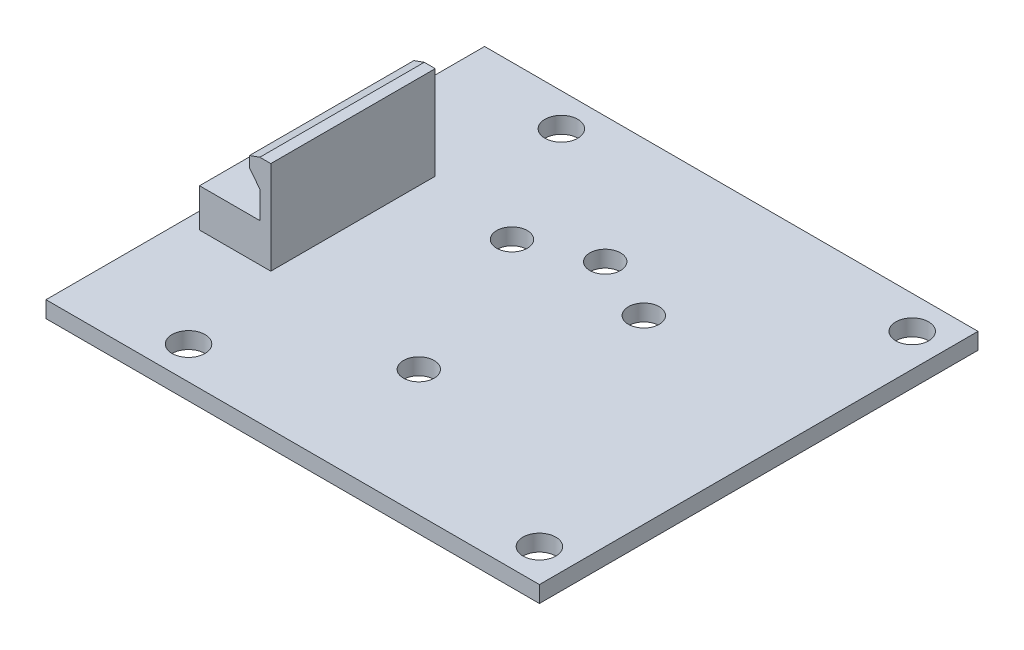
ISO-10303-21;
HEADER;
FILE_DESCRIPTION(('STEP AP214'),'2;1');
FILE_NAME('part.step','',(''),(''),'','','');
FILE_SCHEMA(('AUTOMOTIVE_DESIGN { 1 0 10303 214 1 1 1 1 }'));
ENDSEC;
DATA;
#1=APPLICATION_CONTEXT('core data for automotive mechanical design processes');
#2=APPLICATION_PROTOCOL_DEFINITION('international standard','automotive_design',2000,#1);
#3=PRODUCT_CONTEXT('',#1,'mechanical');
#4=PRODUCT('Part','Part','',(#3));
#5=PRODUCT_RELATED_PRODUCT_CATEGORY('part','',(#4));
#6=PRODUCT_DEFINITION_FORMATION('','',#4);
#7=PRODUCT_DEFINITION_CONTEXT('part definition',#1,'design');
#8=PRODUCT_DEFINITION('design','',#6,#7);
#9=PRODUCT_DEFINITION_SHAPE('','',#8);
#10=(LENGTH_UNIT() NAMED_UNIT(*) SI_UNIT(.MILLI.,.METRE.));
#11=(NAMED_UNIT(*) PLANE_ANGLE_UNIT() SI_UNIT($,.RADIAN.));
#12=(NAMED_UNIT(*) SI_UNIT($,.STERADIAN.) SOLID_ANGLE_UNIT());
#13=UNCERTAINTY_MEASURE_WITH_UNIT(LENGTH_MEASURE(1.E-05),#10,'distance_accuracy_value','');
#14=(GEOMETRIC_REPRESENTATION_CONTEXT(3) GLOBAL_UNCERTAINTY_ASSIGNED_CONTEXT((#13)) GLOBAL_UNIT_ASSIGNED_CONTEXT((#10,
#11,#12)) REPRESENTATION_CONTEXT('',''));
#15=CARTESIAN_POINT('',(0.,0.,0.));
#16=DIRECTION('',(0.,0.,1.));
#17=DIRECTION('',(1.,0.,0.));
#18=AXIS2_PLACEMENT_3D('',#15,#16,#17);
#19=CARTESIAN_POINT('',(0.,3.5,0.));
#20=DIRECTION('',(0.,-1.,0.));
#21=DIRECTION('',(0.,0.,-1.));
#22=AXIS2_PLACEMENT_3D('',#19,#20,#21);
#23=PLANE('',#22);
#24=DIRECTION('',(0.,0.,1.));
#25=VECTOR('',#24,1.);
#26=CARTESIAN_POINT('',(-15.5,3.5,7.50000000000001));
#27=LINE('',#26,#25);
#28=CARTESIAN_POINT('',(-15.5,3.5,-7.49999999999999));
#29=VERTEX_POINT('',#28);
#30=CARTESIAN_POINT('',(-15.5,3.5,7.50000000000001));
#31=VERTEX_POINT('',#30);
#32=EDGE_CURVE('E156',#29,#31,#27,.T.);
#33=ORIENTED_EDGE('',*,*,#32,.F.);
#34=DIRECTION('',(-1.,0.,0.));
#35=VECTOR('',#34,1.);
#36=CARTESIAN_POINT('',(-21.,3.5,-7.49999999999999));
#37=LINE('',#36,#35);
#38=CARTESIAN_POINT('',(-21.,3.5,-7.49999999999999));
#39=VERTEX_POINT('',#38);
#40=EDGE_CURVE('E170',#29,#39,#37,.T.);
#41=ORIENTED_EDGE('',*,*,#40,.T.);
#42=DIRECTION('',(0.,0.,1.));
#43=VECTOR('',#42,1.);
#44=CARTESIAN_POINT('',(-21.,3.5,7.50000000000001));
#45=LINE('',#44,#43);
#46=CARTESIAN_POINT('',(-21.,3.5,7.50000000000001));
#47=VERTEX_POINT('',#46);
#48=EDGE_CURVE('E164',#39,#47,#45,.T.);
#49=ORIENTED_EDGE('',*,*,#48,.T.);
#50=DIRECTION('',(1.,0.,0.));
#51=VECTOR('',#50,1.);
#52=CARTESIAN_POINT('',(-21.,3.5,7.50000000000001));
#53=LINE('',#52,#51);
#54=EDGE_CURVE('E255',#47,#31,#53,.T.);
#55=ORIENTED_EDGE('',*,*,#54,.T.);
#56=EDGE_LOOP('',(#33,#41,#49,#55));
#57=FACE_BOUND('',#56,.T.);
#58=ADVANCED_FACE('F33',(#57),#23,.F.);
#59=CARTESIAN_POINT('',(0.,0.,0.));
#60=DIRECTION('',(0.,1.,0.));
#61=DIRECTION('',(0.,0.,1.));
#62=AXIS2_PLACEMENT_3D('',#59,#60,#61);
#63=PLANE('',#62);
#64=CARTESIAN_POINT('',(19.5,0.,17.));
#65=DIRECTION('',(0.,1.,0.));
#66=DIRECTION('',(0.,0.,1.));
#67=AXIS2_PLACEMENT_3D('',#64,#65,#66);
#68=CIRCLE('',#67,1.5);
#69=CARTESIAN_POINT('',(19.5,0.,18.5));
#70=VERTEX_POINT('',#69);
#71=EDGE_CURVE('E524',#70,#70,#68,.T.);
#72=ORIENTED_EDGE('',*,*,#71,.F.);
#73=EDGE_LOOP('',(#72));
#74=FACE_BOUND('',#73,.T.);
#75=CARTESIAN_POINT('',(19.5,0.,-17.));
#76=DIRECTION('',(0.,1.,0.));
#77=DIRECTION('',(0.,0.,1.));
#78=AXIS2_PLACEMENT_3D('',#75,#76,#77);
#79=CIRCLE('',#78,1.5);
#80=CARTESIAN_POINT('',(19.5,0.,-15.5));
#81=VERTEX_POINT('',#80);
#82=EDGE_CURVE('E526',#81,#81,#79,.T.);
#83=ORIENTED_EDGE('',*,*,#82,.F.);
#84=EDGE_LOOP('',(#83));
#85=FACE_BOUND('',#84,.T.);
#86=CARTESIAN_POINT('',(-12.5,0.,17.));
#87=DIRECTION('',(0.,1.,0.));
#88=DIRECTION('',(0.,0.,1.));
#89=AXIS2_PLACEMENT_3D('',#86,#87,#88);
#90=CIRCLE('',#89,1.5);
#91=CARTESIAN_POINT('',(-12.5,0.,18.5));
#92=VERTEX_POINT('',#91);
#93=EDGE_CURVE('E532',#92,#92,#90,.T.);
#94=ORIENTED_EDGE('',*,*,#93,.F.);
#95=EDGE_LOOP('',(#94));
#96=FACE_BOUND('',#95,.T.);
#97=CARTESIAN_POINT('',(-12.5,0.,-17.));
#98=DIRECTION('',(0.,1.,0.));
#99=DIRECTION('',(0.,0.,1.));
#100=AXIS2_PLACEMENT_3D('',#97,#98,#99);
#101=CIRCLE('',#100,1.5);
#102=CARTESIAN_POINT('',(-12.5,0.,-15.5));
#103=VERTEX_POINT('',#102);
#104=EDGE_CURVE('E538',#103,#103,#101,.T.);
#105=ORIENTED_EDGE('',*,*,#104,.F.);
#106=EDGE_LOOP('',(#105));
#107=FACE_BOUND('',#106,.T.);
#108=DIRECTION('',(0.,0.,-1.));
#109=VECTOR('',#108,1.);
#110=CARTESIAN_POINT('',(22.5,0.,-20.));
#111=LINE('',#110,#109);
#112=CARTESIAN_POINT('',(22.5,0.,20.));
#113=VERTEX_POINT('',#112);
#114=CARTESIAN_POINT('',(22.5,0.,-20.));
#115=VERTEX_POINT('',#114);
#116=EDGE_CURVE('E225',#113,#115,#111,.T.);
#117=ORIENTED_EDGE('',*,*,#116,.T.);
#118=DIRECTION('',(-1.,0.,0.));
#119=VECTOR('',#118,1.);
#120=CARTESIAN_POINT('',(-22.5,0.,-20.));
#121=LINE('',#120,#119);
#122=CARTESIAN_POINT('',(-22.5,0.,-20.));
#123=VERTEX_POINT('',#122);
#124=EDGE_CURVE('E244',#115,#123,#121,.T.);
#125=ORIENTED_EDGE('',*,*,#124,.T.);
#126=DIRECTION('',(0.,0.,1.));
#127=VECTOR('',#126,1.);
#128=CARTESIAN_POINT('',(-22.5,0.,-20.));
#129=LINE('',#128,#127);
#130=CARTESIAN_POINT('',(-22.5,0.,20.));
#131=VERTEX_POINT('',#130);
#132=EDGE_CURVE('E247',#123,#131,#129,.T.);
#133=ORIENTED_EDGE('',*,*,#132,.T.);
#134=DIRECTION('',(1.,0.,0.));
#135=VECTOR('',#134,1.);
#136=CARTESIAN_POINT('',(-22.5,0.,20.));
#137=LINE('',#136,#135);
#138=EDGE_CURVE('E232',#131,#113,#137,.T.);
#139=ORIENTED_EDGE('',*,*,#138,.T.);
#140=EDGE_LOOP('',(#117,#125,#133,#139));
#141=FACE_BOUND('',#140,.T.);
#142=CARTESIAN_POINT('',(0.,0.,-8.5));
#143=DIRECTION('',(0.,1.,0.));
#144=DIRECTION('',(0.,0.,1.));
#145=AXIS2_PLACEMENT_3D('',#142,#143,#144);
#146=CIRCLE('',#145,1.4);
#147=CARTESIAN_POINT('',(0.,0.,-7.1));
#148=VERTEX_POINT('',#147);
#149=EDGE_CURVE('E219',#148,#148,#146,.T.);
#150=ORIENTED_EDGE('',*,*,#149,.F.);
#151=EDGE_LOOP('',(#150));
#152=FACE_BOUND('',#151,.T.);
#153=CARTESIAN_POINT('',(6.01040764008599,0.,-6.01040764008532));
#154=DIRECTION('',(0.,1.,0.));
#155=DIRECTION('',(0.,0.,1.));
#156=AXIS2_PLACEMENT_3D('',#153,#154,#155);
#157=CIRCLE('',#156,1.39999999999956);
#158=CARTESIAN_POINT('',(6.01040764008599,0.,-4.61040764008576));
#159=VERTEX_POINT('',#158);
#160=EDGE_CURVE('E213',#159,#159,#157,.T.);
#161=ORIENTED_EDGE('',*,*,#160,.F.);
#162=EDGE_LOOP('',(#161));
#163=FACE_BOUND('',#162,.T.);
#164=CARTESIAN_POINT('',(-1.89011295036722E-12,0.,8.5));
#165=DIRECTION('',(0.,1.,0.));
#166=DIRECTION('',(0.,0.,1.));
#167=AXIS2_PLACEMENT_3D('',#164,#165,#166);
#168=CIRCLE('',#167,1.39999999999825);
#169=CARTESIAN_POINT('',(-1.89011295036722E-12,0.,9.89999999999825));
#170=VERTEX_POINT('',#169);
#171=EDGE_CURVE('E207',#170,#170,#168,.T.);
#172=ORIENTED_EDGE('',*,*,#171,.F.);
#173=EDGE_LOOP('',(#172));
#174=FACE_BOUND('',#173,.T.);
#175=CARTESIAN_POINT('',(-6.01040764008332,0.,-6.01040764008799));
#176=DIRECTION('',(0.,1.,0.));
#177=DIRECTION('',(0.,0.,1.));
#178=AXIS2_PLACEMENT_3D('',#175,#176,#177);
#179=CIRCLE('',#178,1.39999999999694);
#180=CARTESIAN_POINT('',(-6.01040764008332,0.,-4.61040764009105));
#181=VERTEX_POINT('',#180);
#182=EDGE_CURVE('E203',#181,#181,#179,.T.);
#183=ORIENTED_EDGE('',*,*,#182,.F.);
#184=EDGE_LOOP('',(#183));
#185=FACE_BOUND('',#184,.T.);
#186=DIRECTION('',(1.,0.,0.));
#187=VECTOR('',#186,1.);
#188=CARTESIAN_POINT('',(-21.,0.,7.50000000000001));
#189=LINE('',#188,#187);
#190=CARTESIAN_POINT('',(-21.,0.,7.50000000000001));
#191=VERTEX_POINT('',#190);
#192=CARTESIAN_POINT('',(-14.5,0.,7.50000000000001));
#193=VERTEX_POINT('',#192);
#194=EDGE_CURVE('E181',#191,#193,#189,.T.);
#195=ORIENTED_EDGE('',*,*,#194,.F.);
#196=DIRECTION('',(0.,0.,1.));
#197=VECTOR('',#196,1.);
#198=CARTESIAN_POINT('',(-21.,0.,7.50000000000001));
#199=LINE('',#198,#197);
#200=CARTESIAN_POINT('',(-21.,0.,-7.49999999999999));
#201=VERTEX_POINT('',#200);
#202=EDGE_CURVE('E179',#201,#191,#199,.T.);
#203=ORIENTED_EDGE('',*,*,#202,.F.);
#204=DIRECTION('',(-1.,0.,0.));
#205=VECTOR('',#204,1.);
#206=CARTESIAN_POINT('',(-21.,0.,-7.49999999999999));
#207=LINE('',#206,#205);
#208=CARTESIAN_POINT('',(-14.5,0.,-7.49999999999999));
#209=VERTEX_POINT('',#208);
#210=EDGE_CURVE('E193',#209,#201,#207,.T.);
#211=ORIENTED_EDGE('',*,*,#210,.F.);
#212=DIRECTION('',(0.,0.,-1.));
#213=VECTOR('',#212,1.);
#214=CARTESIAN_POINT('',(-14.5,0.,7.50000000000001));
#215=LINE('',#214,#213);
#216=EDGE_CURVE('E188',#193,#209,#215,.T.);
#217=ORIENTED_EDGE('',*,*,#216,.F.);
#218=EDGE_LOOP('',(#195,#203,#211,#217));
#219=FACE_BOUND('',#218,.T.);
#220=ADVANCED_FACE('F269',(#74,#85,#96,#107,#141,#152,#163,#174,#185,#219),#63,.T.);
#221=CARTESIAN_POINT('',(22.5,-1.5,-20.));
#222=DIRECTION('',(1.,0.,0.));
#223=DIRECTION('',(0.,0.,-1.));
#224=AXIS2_PLACEMENT_3D('',#221,#222,#223);
#225=PLANE('',#224);
#226=ORIENTED_EDGE('',*,*,#116,.F.);
#227=DIRECTION('',(0.,1.,0.));
#228=VECTOR('',#227,1.);
#229=CARTESIAN_POINT('',(22.5,-1.5,20.));
#230=LINE('',#229,#228);
#231=CARTESIAN_POINT('',(22.5,-1.5,20.));
#232=VERTEX_POINT('',#231);
#233=EDGE_CURVE('E11',#232,#113,#230,.T.);
#234=ORIENTED_EDGE('',*,*,#233,.F.);
#235=DIRECTION('',(0.,0.,-1.));
#236=VECTOR('',#235,1.);
#237=CARTESIAN_POINT('',(22.5,-1.5,-20.));
#238=LINE('',#237,#236);
#239=CARTESIAN_POINT('',(22.5,-1.5,-20.));
#240=VERTEX_POINT('',#239);
#241=EDGE_CURVE('E228',#232,#240,#238,.T.);
#242=ORIENTED_EDGE('',*,*,#241,.T.);
#243=DIRECTION('',(0.,1.,0.));
#244=VECTOR('',#243,1.);
#245=CARTESIAN_POINT('',(22.5,-1.5,-20.));
#246=LINE('',#245,#244);
#247=EDGE_CURVE('E241',#240,#115,#246,.T.);
#248=ORIENTED_EDGE('',*,*,#247,.T.);
#249=EDGE_LOOP('',(#226,#234,#242,#248));
#250=FACE_BOUND('',#249,.T.);
#251=ADVANCED_FACE('F35',(#250),#225,.T.);
#252=CARTESIAN_POINT('',(-22.5,-1.5,20.));
#253=DIRECTION('',(0.,0.,1.));
#254=DIRECTION('',(1.,0.,0.));
#255=AXIS2_PLACEMENT_3D('',#252,#253,#254);
#256=PLANE('',#255);
#257=ORIENTED_EDGE('',*,*,#138,.F.);
#258=DIRECTION('',(0.,1.,0.));
#259=VECTOR('',#258,1.);
#260=CARTESIAN_POINT('',(-22.5,-1.5,20.));
#261=LINE('',#260,#259);
#262=CARTESIAN_POINT('',(-22.5,-1.5,20.));
#263=VERTEX_POINT('',#262);
#264=EDGE_CURVE('E43',#263,#131,#261,.T.);
#265=ORIENTED_EDGE('',*,*,#264,.F.);
#266=DIRECTION('',(1.,0.,0.));
#267=VECTOR('',#266,1.);
#268=CARTESIAN_POINT('',(-22.5,-1.5,20.));
#269=LINE('',#268,#267);
#270=EDGE_CURVE('E238',#263,#232,#269,.T.);
#271=ORIENTED_EDGE('',*,*,#270,.T.);
#272=ORIENTED_EDGE('',*,*,#233,.T.);
#273=EDGE_LOOP('',(#257,#265,#271,#272));
#274=FACE_BOUND('',#273,.T.);
#275=ADVANCED_FACE('F333',(#274),#256,.T.);
#276=CARTESIAN_POINT('',(-22.5,-1.5,-20.));
#277=DIRECTION('',(-1.,0.,0.));
#278=DIRECTION('',(0.,0.,1.));
#279=AXIS2_PLACEMENT_3D('',#276,#277,#278);
#280=PLANE('',#279);
#281=ORIENTED_EDGE('',*,*,#132,.F.);
#282=DIRECTION('',(0.,1.,0.));
#283=VECTOR('',#282,1.);
#284=CARTESIAN_POINT('',(-22.5,-1.5,-20.));
#285=LINE('',#284,#283);
#286=CARTESIAN_POINT('',(-22.5,-1.5,-20.));
#287=VERTEX_POINT('',#286);
#288=EDGE_CURVE('E253',#287,#123,#285,.T.);
#289=ORIENTED_EDGE('',*,*,#288,.F.);
#290=DIRECTION('',(0.,0.,1.));
#291=VECTOR('',#290,1.);
#292=CARTESIAN_POINT('',(-22.5,-1.5,-20.));
#293=LINE('',#292,#291);
#294=EDGE_CURVE('E235',#287,#263,#293,.T.);
#295=ORIENTED_EDGE('',*,*,#294,.T.);
#296=ORIENTED_EDGE('',*,*,#264,.T.);
#297=EDGE_LOOP('',(#281,#289,#295,#296));
#298=FACE_BOUND('',#297,.T.);
#299=ADVANCED_FACE('F336',(#298),#280,.T.);
#300=CARTESIAN_POINT('',(-22.5,-1.5,-20.));
#301=DIRECTION('',(0.,0.,-1.));
#302=DIRECTION('',(-1.,0.,0.));
#303=AXIS2_PLACEMENT_3D('',#300,#301,#302);
#304=PLANE('',#303);
#305=ORIENTED_EDGE('',*,*,#124,.F.);
#306=ORIENTED_EDGE('',*,*,#247,.F.);
#307=DIRECTION('',(-1.,0.,0.));
#308=VECTOR('',#307,1.);
#309=CARTESIAN_POINT('',(-22.5,-1.5,-20.));
#310=LINE('',#309,#308);
#311=EDGE_CURVE('E231',#240,#287,#310,.T.);
#312=ORIENTED_EDGE('',*,*,#311,.T.);
#313=ORIENTED_EDGE('',*,*,#288,.T.);
#314=EDGE_LOOP('',(#305,#306,#312,#313));
#315=FACE_BOUND('',#314,.T.);
#316=ADVANCED_FACE('F330',(#315),#304,.T.);
#317=CARTESIAN_POINT('',(0.,-1.5,0.));
#318=DIRECTION('',(0.,1.,0.));
#319=DIRECTION('',(0.,0.,1.));
#320=AXIS2_PLACEMENT_3D('',#317,#318,#319);
#321=PLANE('',#320);
#322=CARTESIAN_POINT('',(19.5,-1.5,17.));
#323=DIRECTION('',(0.,1.,0.));
#324=DIRECTION('',(0.,0.,1.));
#325=AXIS2_PLACEMENT_3D('',#322,#323,#324);
#326=CIRCLE('',#325,1.5);
#327=CARTESIAN_POINT('',(19.5,-1.5,18.5));
#328=VERTEX_POINT('',#327);
#329=EDGE_CURVE('E521',#328,#328,#326,.T.);
#330=ORIENTED_EDGE('',*,*,#329,.T.);
#331=EDGE_LOOP('',(#330));
#332=FACE_BOUND('',#331,.T.);
#333=CARTESIAN_POINT('',(19.5,-1.5,-17.));
#334=DIRECTION('',(0.,1.,0.));
#335=DIRECTION('',(0.,0.,1.));
#336=AXIS2_PLACEMENT_3D('',#333,#334,#335);
#337=CIRCLE('',#336,1.5);
#338=CARTESIAN_POINT('',(19.5,-1.5,-15.5));
#339=VERTEX_POINT('',#338);
#340=EDGE_CURVE('E529',#339,#339,#337,.T.);
#341=ORIENTED_EDGE('',*,*,#340,.T.);
#342=EDGE_LOOP('',(#341));
#343=FACE_BOUND('',#342,.T.);
#344=CARTESIAN_POINT('',(-12.5,-1.5,17.));
#345=DIRECTION('',(0.,1.,0.));
#346=DIRECTION('',(0.,0.,1.));
#347=AXIS2_PLACEMENT_3D('',#344,#345,#346);
#348=CIRCLE('',#347,1.5);
#349=CARTESIAN_POINT('',(-12.5,-1.5,18.5));
#350=VERTEX_POINT('',#349);
#351=EDGE_CURVE('E535',#350,#350,#348,.T.);
#352=ORIENTED_EDGE('',*,*,#351,.T.);
#353=EDGE_LOOP('',(#352));
#354=FACE_BOUND('',#353,.T.);
#355=CARTESIAN_POINT('',(-12.5,-1.5,-17.));
#356=DIRECTION('',(0.,1.,0.));
#357=DIRECTION('',(0.,0.,1.));
#358=AXIS2_PLACEMENT_3D('',#355,#356,#357);
#359=CIRCLE('',#358,1.5);
#360=CARTESIAN_POINT('',(-12.5,-1.5,-15.5));
#361=VERTEX_POINT('',#360);
#362=EDGE_CURVE('E279',#361,#361,#359,.T.);
#363=ORIENTED_EDGE('',*,*,#362,.T.);
#364=EDGE_LOOP('',(#363));
#365=FACE_BOUND('',#364,.T.);
#366=CARTESIAN_POINT('',(-6.01040764008332,-1.5,-6.01040764008799));
#367=DIRECTION('',(0.,1.,0.));
#368=DIRECTION('',(0.,0.,1.));
#369=AXIS2_PLACEMENT_3D('',#366,#367,#368);
#370=CIRCLE('',#369,1.39999999999694);
#371=CARTESIAN_POINT('',(-6.01040764008332,-1.5,-4.61040764009105));
#372=VERTEX_POINT('',#371);
#373=EDGE_CURVE('E204',#372,#372,#370,.T.);
#374=ORIENTED_EDGE('',*,*,#373,.T.);
#375=EDGE_LOOP('',(#374));
#376=FACE_BOUND('',#375,.T.);
#377=CARTESIAN_POINT('',(-1.89011295036722E-12,-1.5,8.5));
#378=DIRECTION('',(0.,1.,0.));
#379=DIRECTION('',(0.,0.,1.));
#380=AXIS2_PLACEMENT_3D('',#377,#378,#379);
#381=CIRCLE('',#380,1.39999999999825);
#382=CARTESIAN_POINT('',(-1.89011295036722E-12,-1.5,9.89999999999825));
#383=VERTEX_POINT('',#382);
#384=EDGE_CURVE('E210',#383,#383,#381,.T.);
#385=ORIENTED_EDGE('',*,*,#384,.T.);
#386=EDGE_LOOP('',(#385));
#387=FACE_BOUND('',#386,.T.);
#388=CARTESIAN_POINT('',(6.01040764008599,-1.5,-6.01040764008532));
#389=DIRECTION('',(0.,1.,0.));
#390=DIRECTION('',(0.,0.,1.));
#391=AXIS2_PLACEMENT_3D('',#388,#389,#390);
#392=CIRCLE('',#391,1.39999999999956);
#393=CARTESIAN_POINT('',(6.01040764008599,-1.5,-4.61040764008576));
#394=VERTEX_POINT('',#393);
#395=EDGE_CURVE('E216',#394,#394,#392,.T.);
#396=ORIENTED_EDGE('',*,*,#395,.T.);
#397=EDGE_LOOP('',(#396));
#398=FACE_BOUND('',#397,.T.);
#399=CARTESIAN_POINT('',(0.,-1.5,-8.5));
#400=DIRECTION('',(0.,1.,0.));
#401=DIRECTION('',(0.,0.,1.));
#402=AXIS2_PLACEMENT_3D('',#399,#400,#401);
#403=CIRCLE('',#402,1.4);
#404=CARTESIAN_POINT('',(0.,-1.5,-7.1));
#405=VERTEX_POINT('',#404);
#406=EDGE_CURVE('E222',#405,#405,#403,.T.);
#407=ORIENTED_EDGE('',*,*,#406,.T.);
#408=EDGE_LOOP('',(#407));
#409=FACE_BOUND('',#408,.T.);
#410=ORIENTED_EDGE('',*,*,#241,.F.);
#411=ORIENTED_EDGE('',*,*,#270,.F.);
#412=ORIENTED_EDGE('',*,*,#294,.F.);
#413=ORIENTED_EDGE('',*,*,#311,.F.);
#414=EDGE_LOOP('',(#410,#411,#412,#413));
#415=FACE_BOUND('',#414,.T.);
#416=ADVANCED_FACE('F327',(#332,#343,#354,#365,#376,#387,#398,#409,#415),#321,.F.);
#417=CARTESIAN_POINT('',(0.,-1.5,-8.5));
#418=DIRECTION('',(0.,1.,0.));
#419=DIRECTION('',(0.,0.,1.));
#420=AXIS2_PLACEMENT_3D('',#417,#418,#419);
#421=CYLINDRICAL_SURFACE('',#420,1.4);
#422=ORIENTED_EDGE('',*,*,#406,.F.);
#423=EDGE_LOOP('',(#422));
#424=FACE_BOUND('',#423,.T.);
#425=ORIENTED_EDGE('',*,*,#149,.T.);
#426=EDGE_LOOP('',(#425));
#427=FACE_BOUND('',#426,.T.);
#428=ADVANCED_FACE('F323',(#424,#427),#421,.F.);
#429=CARTESIAN_POINT('',(6.01040764008599,-1.5,-6.01040764008532));
#430=DIRECTION('',(0.,1.,0.));
#431=DIRECTION('',(0.,0.,1.));
#432=AXIS2_PLACEMENT_3D('',#429,#430,#431);
#433=CYLINDRICAL_SURFACE('',#432,1.39999999999956);
#434=ORIENTED_EDGE('',*,*,#395,.F.);
#435=EDGE_LOOP('',(#434));
#436=FACE_BOUND('',#435,.T.);
#437=ORIENTED_EDGE('',*,*,#160,.T.);
#438=EDGE_LOOP('',(#437));
#439=FACE_BOUND('',#438,.T.);
#440=ADVANCED_FACE('F319',(#436,#439),#433,.F.);
#441=CARTESIAN_POINT('',(-1.89011295036722E-12,-1.5,8.5));
#442=DIRECTION('',(0.,1.,0.));
#443=DIRECTION('',(0.,0.,1.));
#444=AXIS2_PLACEMENT_3D('',#441,#442,#443);
#445=CYLINDRICAL_SURFACE('',#444,1.39999999999825);
#446=ORIENTED_EDGE('',*,*,#384,.F.);
#447=EDGE_LOOP('',(#446));
#448=FACE_BOUND('',#447,.T.);
#449=ORIENTED_EDGE('',*,*,#171,.T.);
#450=EDGE_LOOP('',(#449));
#451=FACE_BOUND('',#450,.T.);
#452=ADVANCED_FACE('F315',(#448,#451),#445,.F.);
#453=CARTESIAN_POINT('',(-6.01040764008332,-1.5,-6.01040764008799));
#454=DIRECTION('',(0.,1.,0.));
#455=DIRECTION('',(0.,0.,1.));
#456=AXIS2_PLACEMENT_3D('',#453,#454,#455);
#457=CYLINDRICAL_SURFACE('',#456,1.39999999999694);
#458=ORIENTED_EDGE('',*,*,#373,.F.);
#459=EDGE_LOOP('',(#458));
#460=FACE_BOUND('',#459,.T.);
#461=ORIENTED_EDGE('',*,*,#182,.T.);
#462=EDGE_LOOP('',(#461));
#463=FACE_BOUND('',#462,.T.);
#464=ADVANCED_FACE('F312',(#460,#463),#457,.F.);
#465=CARTESIAN_POINT('',(-21.,3.5,7.50000000000001));
#466=DIRECTION('',(1.,0.,0.));
#467=DIRECTION('',(0.,0.,-1.));
#468=AXIS2_PLACEMENT_3D('',#465,#466,#467);
#469=PLANE('',#468);
#470=ORIENTED_EDGE('',*,*,#202,.T.);
#471=DIRECTION('',(0.,-1.,0.));
#472=VECTOR('',#471,1.);
#473=CARTESIAN_POINT('',(-21.,3.5,7.50000000000001));
#474=LINE('',#473,#472);
#475=EDGE_CURVE('E201',#47,#191,#474,.T.);
#476=ORIENTED_EDGE('',*,*,#475,.F.);
#477=ORIENTED_EDGE('',*,*,#48,.F.);
#478=DIRECTION('',(0.,-1.,0.));
#479=VECTOR('',#478,1.);
#480=CARTESIAN_POINT('',(-21.,3.5,-7.49999999999999));
#481=LINE('',#480,#479);
#482=EDGE_CURVE('E195',#39,#201,#481,.T.);
#483=ORIENTED_EDGE('',*,*,#482,.T.);
#484=EDGE_LOOP('',(#470,#476,#477,#483));
#485=FACE_BOUND('',#484,.T.);
#486=ADVANCED_FACE('F262',(#485),#469,.F.);
#487=CARTESIAN_POINT('',(-21.,3.5,7.50000000000001));
#488=DIRECTION('',(0.,0.,-1.));
#489=DIRECTION('',(-1.,0.,0.));
#490=AXIS2_PLACEMENT_3D('',#487,#488,#489);
#491=PLANE('',#490);
#492=ORIENTED_EDGE('',*,*,#194,.T.);
#493=DIRECTION('',(0.,-1.,0.));
#494=VECTOR('',#493,1.);
#495=CARTESIAN_POINT('',(-14.5,3.5,7.50000000000001));
#496=LINE('',#495,#494);
#497=CARTESIAN_POINT('',(-14.5,8.5,7.50000000000001));
#498=VERTEX_POINT('',#497);
#499=EDGE_CURVE('E198',#498,#193,#496,.T.);
#500=ORIENTED_EDGE('',*,*,#499,.F.);
#501=DIRECTION('',(1.,0.,0.));
#502=VECTOR('',#501,1.);
#503=CARTESIAN_POINT('',(-14.5,8.5,7.50000000000001));
#504=LINE('',#503,#502);
#505=CARTESIAN_POINT('',(-15.5,8.5,7.50000000000001));
#506=VERTEX_POINT('',#505);
#507=EDGE_CURVE('E141',#506,#498,#504,.T.);
#508=ORIENTED_EDGE('',*,*,#507,.F.);
#509=DIRECTION('',(-0.942809041582063,-0.333333333333333,0.));
#510=VECTOR('',#509,1.);
#511=CARTESIAN_POINT('',(-15.5,8.5,7.50000000000001));
#512=LINE('',#511,#510);
#513=CARTESIAN_POINT('',(-16.4428090415821,8.16666666666667,7.50000000000001));
#514=VERTEX_POINT('',#513);
#515=EDGE_CURVE('E136',#506,#514,#512,.T.);
#516=ORIENTED_EDGE('',*,*,#515,.T.);
#517=DIRECTION('',(0.,-1.,0.));
#518=VECTOR('',#517,1.);
#519=CARTESIAN_POINT('',(-16.4428090415821,8.16666666666667,7.50000000000001));
#520=LINE('',#519,#518);
#521=CARTESIAN_POINT('',(-16.4428090415821,7.16666666666667,7.50000000000001));
#522=VERTEX_POINT('',#521);
#523=EDGE_CURVE('E278',#514,#522,#520,.T.);
#524=ORIENTED_EDGE('',*,*,#523,.T.);
#525=DIRECTION('',(0.628539361054709,-0.777777777777778,0.));
#526=VECTOR('',#525,1.);
#527=CARTESIAN_POINT('',(-16.4428090415821,7.16666666666667,7.50000000000001));
#528=LINE('',#527,#526);
#529=CARTESIAN_POINT('',(-15.5,6.,7.50000000000001));
#530=VERTEX_POINT('',#529);
#531=EDGE_CURVE('E150',#522,#530,#528,.T.);
#532=ORIENTED_EDGE('',*,*,#531,.T.);
#533=DIRECTION('',(0.,-1.,0.));
#534=VECTOR('',#533,1.);
#535=CARTESIAN_POINT('',(-15.5,8.5,7.50000000000001));
#536=LINE('',#535,#534);
#537=EDGE_CURVE('E161',#530,#31,#536,.T.);
#538=ORIENTED_EDGE('',*,*,#537,.T.);
#539=ORIENTED_EDGE('',*,*,#54,.F.);
#540=ORIENTED_EDGE('',*,*,#475,.T.);
#541=EDGE_LOOP('',(#492,#500,#508,#516,#524,#532,#538,#539,#540));
#542=FACE_BOUND('',#541,.T.);
#543=ADVANCED_FACE('F263',(#542),#491,.F.);
#544=CARTESIAN_POINT('',(-14.5,3.5,7.50000000000001));
#545=DIRECTION('',(-1.,0.,0.));
#546=DIRECTION('',(0.,0.,1.));
#547=AXIS2_PLACEMENT_3D('',#544,#545,#546);
#548=PLANE('',#547);
#549=ORIENTED_EDGE('',*,*,#216,.T.);
#550=DIRECTION('',(0.,-1.,0.));
#551=VECTOR('',#550,1.);
#552=CARTESIAN_POINT('',(-14.5,3.5,-7.49999999999999));
#553=LINE('',#552,#551);
#554=CARTESIAN_POINT('',(-14.5,8.5,-7.49999999999999));
#555=VERTEX_POINT('',#554);
#556=EDGE_CURVE('E58',#555,#209,#553,.T.);
#557=ORIENTED_EDGE('',*,*,#556,.F.);
#558=DIRECTION('',(0.,0.,-1.));
#559=VECTOR('',#558,1.);
#560=CARTESIAN_POINT('',(-14.5,8.5,7.50000000000001));
#561=LINE('',#560,#559);
#562=EDGE_CURVE('E154',#498,#555,#561,.T.);
#563=ORIENTED_EDGE('',*,*,#562,.F.);
#564=ORIENTED_EDGE('',*,*,#499,.T.);
#565=EDGE_LOOP('',(#549,#557,#563,#564));
#566=FACE_BOUND('',#565,.T.);
#567=ADVANCED_FACE('F267',(#566),#548,.F.);
#568=CARTESIAN_POINT('',(-21.,3.5,-7.49999999999999));
#569=DIRECTION('',(0.,0.,1.));
#570=DIRECTION('',(1.,0.,0.));
#571=AXIS2_PLACEMENT_3D('',#568,#569,#570);
#572=PLANE('',#571);
#573=ORIENTED_EDGE('',*,*,#210,.T.);
#574=ORIENTED_EDGE('',*,*,#482,.F.);
#575=ORIENTED_EDGE('',*,*,#40,.F.);
#576=DIRECTION('',(0.,-1.,0.));
#577=VECTOR('',#576,1.);
#578=CARTESIAN_POINT('',(-15.5,8.5,-7.49999999999999));
#579=LINE('',#578,#577);
#580=CARTESIAN_POINT('',(-15.5,6.,-7.49999999999999));
#581=VERTEX_POINT('',#580);
#582=EDGE_CURVE('E37',#581,#29,#579,.T.);
#583=ORIENTED_EDGE('',*,*,#582,.F.);
#584=DIRECTION('',(0.628539361054709,-0.777777777777778,0.));
#585=VECTOR('',#584,1.);
#586=CARTESIAN_POINT('',(-16.4428090415821,7.16666666666667,-7.49999999999999));
#587=LINE('',#586,#585);
#588=CARTESIAN_POINT('',(-16.4428090415821,7.16666666666667,-7.49999999999999));
#589=VERTEX_POINT('',#588);
#590=EDGE_CURVE('E270',#589,#581,#587,.T.);
#591=ORIENTED_EDGE('',*,*,#590,.F.);
#592=DIRECTION('',(0.,-1.,0.));
#593=VECTOR('',#592,1.);
#594=CARTESIAN_POINT('',(-16.4428090415821,8.16666666666667,-7.49999999999999));
#595=LINE('',#594,#593);
#596=CARTESIAN_POINT('',(-16.4428090415821,8.16666666666667,-7.49999999999999));
#597=VERTEX_POINT('',#596);
#598=EDGE_CURVE('E149',#597,#589,#595,.T.);
#599=ORIENTED_EDGE('',*,*,#598,.F.);
#600=DIRECTION('',(-0.942809041582063,-0.333333333333333,0.));
#601=VECTOR('',#600,1.);
#602=CARTESIAN_POINT('',(-15.5,8.5,-7.49999999999999));
#603=LINE('',#602,#601);
#604=CARTESIAN_POINT('',(-15.5,8.5,-7.49999999999999));
#605=VERTEX_POINT('',#604);
#606=EDGE_CURVE('E134',#605,#597,#603,.T.);
#607=ORIENTED_EDGE('',*,*,#606,.F.);
#608=DIRECTION('',(-1.,0.,0.));
#609=VECTOR('',#608,1.);
#610=CARTESIAN_POINT('',(-14.5,8.5,-7.49999999999999));
#611=LINE('',#610,#609);
#612=EDGE_CURVE('E142',#555,#605,#611,.T.);
#613=ORIENTED_EDGE('',*,*,#612,.F.);
#614=ORIENTED_EDGE('',*,*,#556,.T.);
#615=EDGE_LOOP('',(#573,#574,#575,#583,#591,#599,#607,#613,#614));
#616=FACE_BOUND('',#615,.T.);
#617=ADVANCED_FACE('F145',(#616),#572,.F.);
#618=CARTESIAN_POINT('',(-15.5,8.5,7.50000000000001));
#619=DIRECTION('',(1.,0.,0.));
#620=DIRECTION('',(0.,0.,-1.));
#621=AXIS2_PLACEMENT_3D('',#618,#619,#620);
#622=PLANE('',#621);
#623=ORIENTED_EDGE('',*,*,#537,.F.);
#624=DIRECTION('',(0.,0.,1.));
#625=VECTOR('',#624,1.);
#626=CARTESIAN_POINT('',(-15.5,6.,-7.49999999999999));
#627=LINE('',#626,#625);
#628=EDGE_CURVE('E169',#581,#530,#627,.T.);
#629=ORIENTED_EDGE('',*,*,#628,.F.);
#630=ORIENTED_EDGE('',*,*,#582,.T.);
#631=ORIENTED_EDGE('',*,*,#32,.T.);
#632=EDGE_LOOP('',(#623,#629,#630,#631));
#633=FACE_BOUND('',#632,.T.);
#634=ADVANCED_FACE('F289',(#633),#622,.F.);
#635=CARTESIAN_POINT('',(0.,8.5,0.));
#636=DIRECTION('',(0.,1.,0.));
#637=DIRECTION('',(0.,0.,1.));
#638=AXIS2_PLACEMENT_3D('',#635,#636,#637);
#639=PLANE('',#638);
#640=ORIENTED_EDGE('',*,*,#562,.T.);
#641=ORIENTED_EDGE('',*,*,#612,.T.);
#642=DIRECTION('',(0.,0.,1.));
#643=VECTOR('',#642,1.);
#644=CARTESIAN_POINT('',(-15.5,8.5,7.50000000000001));
#645=LINE('',#644,#643);
#646=EDGE_CURVE('E131',#605,#506,#645,.T.);
#647=ORIENTED_EDGE('',*,*,#646,.T.);
#648=ORIENTED_EDGE('',*,*,#507,.T.);
#649=EDGE_LOOP('',(#640,#641,#647,#648));
#650=FACE_BOUND('',#649,.T.);
#651=ADVANCED_FACE('F152',(#650),#639,.T.);
#652=CARTESIAN_POINT('',(-16.4428090415821,7.16666666666667,-7.49999999999999));
#653=DIRECTION('',(-0.777777777777778,-0.628539361054709,0.));
#654=DIRECTION('',(0.628539361054709,-0.777777777777778,0.));
#655=AXIS2_PLACEMENT_3D('',#652,#653,#654);
#656=PLANE('',#655);
#657=ORIENTED_EDGE('',*,*,#531,.F.);
#658=DIRECTION('',(0.,0.,1.));
#659=VECTOR('',#658,1.);
#660=CARTESIAN_POINT('',(-16.4428090415821,7.16666666666667,-7.49999999999999));
#661=LINE('',#660,#659);
#662=EDGE_CURVE('E274',#589,#522,#661,.T.);
#663=ORIENTED_EDGE('',*,*,#662,.F.);
#664=ORIENTED_EDGE('',*,*,#590,.T.);
#665=ORIENTED_EDGE('',*,*,#628,.T.);
#666=EDGE_LOOP('',(#657,#663,#664,#665));
#667=FACE_BOUND('',#666,.T.);
#668=ADVANCED_FACE('F288',(#667),#656,.T.);
#669=CARTESIAN_POINT('',(-16.4428090415821,8.16666666666667,-7.49999999999999));
#670=DIRECTION('',(-1.,0.,0.));
#671=DIRECTION('',(0.,0.,1.));
#672=AXIS2_PLACEMENT_3D('',#669,#670,#671);
#673=PLANE('',#672);
#674=ORIENTED_EDGE('',*,*,#523,.F.);
#675=DIRECTION('',(0.,0.,1.));
#676=VECTOR('',#675,1.);
#677=CARTESIAN_POINT('',(-16.4428090415821,8.16666666666667,-7.49999999999999));
#678=LINE('',#677,#676);
#679=EDGE_CURVE('E272',#597,#514,#678,.T.);
#680=ORIENTED_EDGE('',*,*,#679,.F.);
#681=ORIENTED_EDGE('',*,*,#598,.T.);
#682=ORIENTED_EDGE('',*,*,#662,.T.);
#683=EDGE_LOOP('',(#674,#680,#681,#682));
#684=FACE_BOUND('',#683,.T.);
#685=ADVANCED_FACE('F286',(#684),#673,.T.);
#686=CARTESIAN_POINT('',(-15.5,8.5,-7.49999999999999));
#687=DIRECTION('',(-0.333333333333333,0.942809041582063,0.));
#688=DIRECTION('',(-0.942809041582063,-0.333333333333333,0.));
#689=AXIS2_PLACEMENT_3D('',#686,#687,#688);
#690=PLANE('',#689);
#691=ORIENTED_EDGE('',*,*,#515,.F.);
#692=ORIENTED_EDGE('',*,*,#646,.F.);
#693=ORIENTED_EDGE('',*,*,#606,.T.);
#694=ORIENTED_EDGE('',*,*,#679,.T.);
#695=EDGE_LOOP('',(#691,#692,#693,#694));
#696=FACE_BOUND('',#695,.T.);
#697=ADVANCED_FACE('F133',(#696),#690,.T.);
#698=CARTESIAN_POINT('',(-12.5,-1.5,-17.));
#699=DIRECTION('',(0.,1.,0.));
#700=DIRECTION('',(0.,0.,1.));
#701=AXIS2_PLACEMENT_3D('',#698,#699,#700);
#702=CYLINDRICAL_SURFACE('',#701,1.5);
#703=ORIENTED_EDGE('',*,*,#362,.F.);
#704=EDGE_LOOP('',(#703));
#705=FACE_BOUND('',#704,.T.);
#706=ORIENTED_EDGE('',*,*,#104,.T.);
#707=EDGE_LOOP('',(#706));
#708=FACE_BOUND('',#707,.T.);
#709=ADVANCED_FACE('F466',(#705,#708),#702,.F.);
#710=CARTESIAN_POINT('',(-12.5,-1.5,17.));
#711=DIRECTION('',(0.,1.,0.));
#712=DIRECTION('',(0.,0.,1.));
#713=AXIS2_PLACEMENT_3D('',#710,#711,#712);
#714=CYLINDRICAL_SURFACE('',#713,1.5);
#715=ORIENTED_EDGE('',*,*,#351,.F.);
#716=EDGE_LOOP('',(#715));
#717=FACE_BOUND('',#716,.T.);
#718=ORIENTED_EDGE('',*,*,#93,.T.);
#719=EDGE_LOOP('',(#718));
#720=FACE_BOUND('',#719,.T.);
#721=ADVANCED_FACE('F484',(#717,#720),#714,.F.);
#722=CARTESIAN_POINT('',(19.5,-1.5,-17.));
#723=DIRECTION('',(0.,1.,0.));
#724=DIRECTION('',(0.,0.,1.));
#725=AXIS2_PLACEMENT_3D('',#722,#723,#724);
#726=CYLINDRICAL_SURFACE('',#725,1.5);
#727=ORIENTED_EDGE('',*,*,#340,.F.);
#728=EDGE_LOOP('',(#727));
#729=FACE_BOUND('',#728,.T.);
#730=ORIENTED_EDGE('',*,*,#82,.T.);
#731=EDGE_LOOP('',(#730));
#732=FACE_BOUND('',#731,.T.);
#733=ADVANCED_FACE('F494',(#729,#732),#726,.F.);
#734=CARTESIAN_POINT('',(19.5,-1.5,17.));
#735=DIRECTION('',(0.,1.,0.));
#736=DIRECTION('',(0.,0.,1.));
#737=AXIS2_PLACEMENT_3D('',#734,#735,#736);
#738=CYLINDRICAL_SURFACE('',#737,1.5);
#739=ORIENTED_EDGE('',*,*,#329,.F.);
#740=EDGE_LOOP('',(#739));
#741=FACE_BOUND('',#740,.T.);
#742=ORIENTED_EDGE('',*,*,#71,.T.);
#743=EDGE_LOOP('',(#742));
#744=FACE_BOUND('',#743,.T.);
#745=ADVANCED_FACE('F504',(#741,#744),#738,.F.);
#746=CLOSED_SHELL('',(#58,#220,#251,#275,#299,#316,#416,#428,#440,#452,#464,#486,#543,#567,#617,
#634,#651,#668,#685,#697,#709,#721,#733,#745));
#747=MANIFOLD_SOLID_BREP('B2',#746);
#748=ADVANCED_BREP_SHAPE_REPRESENTATION('',(#18,#747),#14);
#749=SHAPE_DEFINITION_REPRESENTATION(#9,#748);
ENDSEC;
END-ISO-10303-21;
